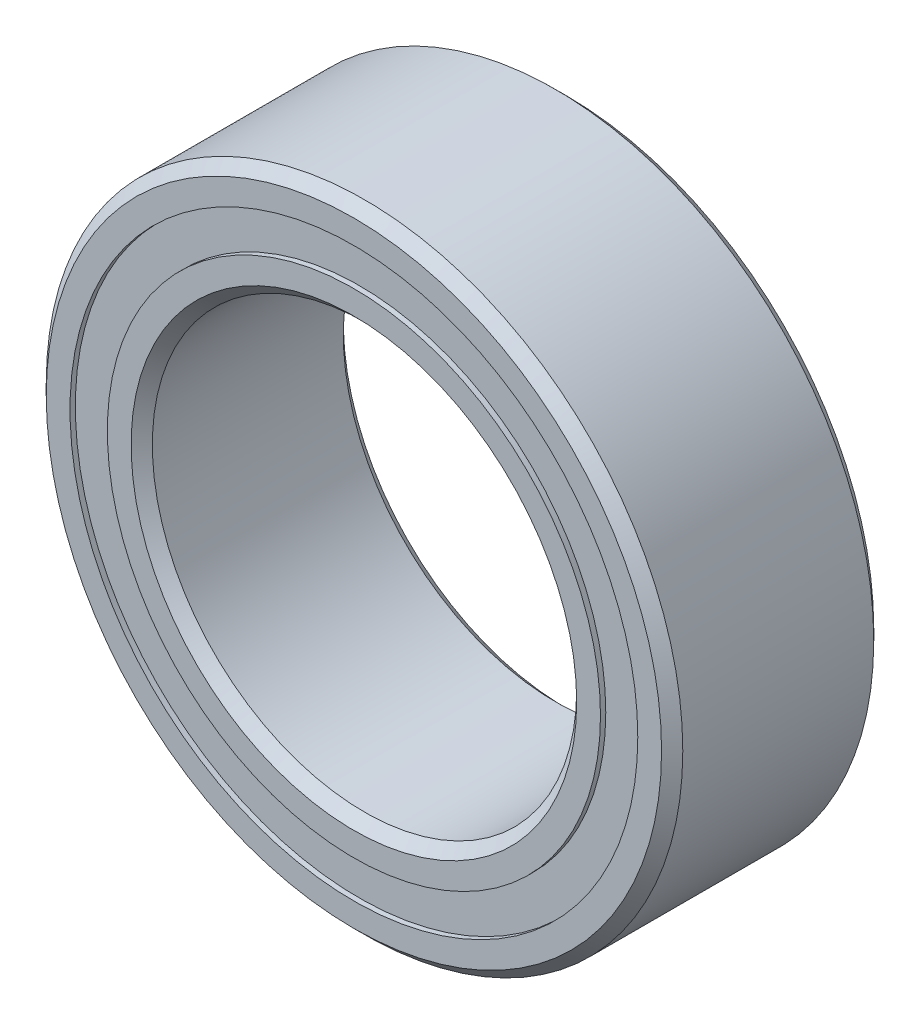
ISO-10303-21;
HEADER;
FILE_DESCRIPTION(('STEP AP214'),'2;1');
FILE_NAME('part.step','',(''),(''),'','','');
FILE_SCHEMA(('AUTOMOTIVE_DESIGN { 1 0 10303 214 1 1 1 1 }'));
ENDSEC;
DATA;
#1=APPLICATION_CONTEXT('core data for automotive mechanical design processes');
#2=APPLICATION_PROTOCOL_DEFINITION('international standard','automotive_design',2000,#1);
#3=PRODUCT_CONTEXT('',#1,'mechanical');
#4=PRODUCT('Part','Part','',(#3));
#5=PRODUCT_RELATED_PRODUCT_CATEGORY('part','',(#4));
#6=PRODUCT_DEFINITION_FORMATION('','',#4);
#7=PRODUCT_DEFINITION_CONTEXT('part definition',#1,'design');
#8=PRODUCT_DEFINITION('design','',#6,#7);
#9=PRODUCT_DEFINITION_SHAPE('','',#8);
#10=(LENGTH_UNIT() NAMED_UNIT(*) SI_UNIT(.MILLI.,.METRE.));
#11=(NAMED_UNIT(*) PLANE_ANGLE_UNIT() SI_UNIT($,.RADIAN.));
#12=(NAMED_UNIT(*) SI_UNIT($,.STERADIAN.) SOLID_ANGLE_UNIT());
#13=UNCERTAINTY_MEASURE_WITH_UNIT(LENGTH_MEASURE(1.E-05),#10,'distance_accuracy_value','');
#14=(GEOMETRIC_REPRESENTATION_CONTEXT(3) GLOBAL_UNCERTAINTY_ASSIGNED_CONTEXT((#13)) GLOBAL_UNIT_ASSIGNED_CONTEXT((#10,
#11,#12)) REPRESENTATION_CONTEXT('',''));
#15=CARTESIAN_POINT('',(0.,0.,0.));
#16=DIRECTION('',(0.,0.,1.));
#17=DIRECTION('',(1.,0.,0.));
#18=AXIS2_PLACEMENT_3D('',#15,#16,#17);
#19=CARTESIAN_POINT('',(-1.98437500000003,-3.43703832126947,0.));
#20=DIRECTION('',(-0.500000000000007,-0.866025403784435,0.));
#21=DIRECTION('',(0.,0.,-1.));
#22=AXIS2_PLACEMENT_3D('',#19,#20,#21);
#23=SPHERICAL_SURFACE('',#22,0.758760243513404);
#24=CARTESIAN_POINT('',(-2.36375512175674,-4.09414396753375,0.));
#25=VERTEX_POINT('',#24);
#26=VERTEX_LOOP('',#25);
#27=FACE_BOUND('',#26,.T.);
#28=CARTESIAN_POINT('',(-1.60499487824332,-2.7799326750052,0.));
#29=VERTEX_POINT('',#28);
#30=VERTEX_LOOP('',#29);
#31=FACE_BOUND('',#30,.T.);
#32=ADVANCED_FACE('P0_F16',(#27,#31),#23,.T.);
#33=CLOSED_SHELL('',(#32));
#34=MANIFOLD_SOLID_BREP('P0_B1',#33);
#35=CARTESIAN_POINT('',(0.,3.96875,0.));
#36=DIRECTION('',(0.,1.,0.));
#37=DIRECTION('',(0.,0.,-1.));
#38=AXIS2_PLACEMENT_3D('',#35,#36,#37);
#39=SPHERICAL_SURFACE('',#38,0.758760243513404);
#40=CARTESIAN_POINT('',(0.,3.2099897564866,0.));
#41=VERTEX_POINT('',#40);
#42=VERTEX_LOOP('',#41);
#43=FACE_BOUND('',#42,.T.);
#44=CARTESIAN_POINT('',(0.,4.7275102435134,0.));
#45=VERTEX_POINT('',#44);
#46=VERTEX_LOOP('',#45);
#47=FACE_BOUND('',#46,.T.);
#48=ADVANCED_FACE('P1_F16',(#43,#47),#39,.T.);
#49=CLOSED_SHELL('',(#48));
#50=MANIFOLD_SOLID_BREP('P1_B1',#49);
#51=CARTESIAN_POINT('',(3.43703832126948,-1.98437500000002,0.));
#52=DIRECTION('',(0.866025403784437,-0.500000000000004,0.));
#53=DIRECTION('',(0.,0.,-1.));
#54=AXIS2_PLACEMENT_3D('',#51,#52,#53);
#55=SPHERICAL_SURFACE('',#54,0.758760243513404);
#56=CARTESIAN_POINT('',(4.09414396753376,-2.36375512175672,0.));
#57=VERTEX_POINT('',#56);
#58=VERTEX_LOOP('',#57);
#59=FACE_BOUND('',#58,.T.);
#60=CARTESIAN_POINT('',(2.77993267500521,-1.60499487824331,0.));
#61=VERTEX_POINT('',#60);
#62=VERTEX_LOOP('',#61);
#63=FACE_BOUND('',#62,.T.);
#64=ADVANCED_FACE('P2_F16',(#59,#63),#55,.T.);
#65=CLOSED_SHELL('',(#64));
#66=MANIFOLD_SOLID_BREP('P2_B1',#65);
#67=CARTESIAN_POINT('',(3.96875,0.,0.));
#68=DIRECTION('',(1.,0.,0.));
#69=DIRECTION('',(0.,0.,-1.));
#70=AXIS2_PLACEMENT_3D('',#67,#68,#69);
#71=SPHERICAL_SURFACE('',#70,0.758760243513404);
#72=CARTESIAN_POINT('',(3.2099897564866,0.,0.));
#73=VERTEX_POINT('',#72);
#74=VERTEX_LOOP('',#73);
#75=FACE_BOUND('',#74,.T.);
#76=CARTESIAN_POINT('',(4.7275102435134,0.,0.));
#77=VERTEX_POINT('',#76);
#78=VERTEX_LOOP('',#77);
#79=FACE_BOUND('',#78,.T.);
#80=ADVANCED_FACE('P3_F16',(#75,#79),#71,.T.);
#81=CLOSED_SHELL('',(#80));
#82=MANIFOLD_SOLID_BREP('P3_B1',#81);
#83=CARTESIAN_POINT('',(0.,0.,0.));
#84=DIRECTION('',(0.,0.,1.));
#85=DIRECTION('',(1.,0.,0.));
#86=AXIS2_PLACEMENT_3D('',#83,#84,#85);
#87=TOROIDAL_SURFACE('',#86,3.96875,0.758760243513404);
#88=CARTESIAN_POINT('',(0.,0.,-0.705555555555556));
#89=DIRECTION('',(0.,0.,1.));
#90=DIRECTION('',(1.,0.,0.));
#91=AXIS2_PLACEMENT_3D('',#88,#89,#90);
#92=CIRCLE('',#91,4.24787087912088);
#93=CARTESIAN_POINT('',(4.24787087912088,0.,-0.705555555555556));
#94=VERTEX_POINT('',#93);
#95=EDGE_CURVE('P4_E33',#94,#94,#92,.F.);
#96=ORIENTED_EDGE('',*,*,#95,.T.);
#97=EDGE_LOOP('',(#96));
#98=FACE_BOUND('',#97,.T.);
#99=CARTESIAN_POINT('',(0.,0.,0.705555555555555));
#100=DIRECTION('',(0.,0.,1.));
#101=DIRECTION('',(1.,0.,0.));
#102=AXIS2_PLACEMENT_3D('',#99,#100,#101);
#103=CIRCLE('',#102,4.24787087912088);
#104=CARTESIAN_POINT('',(4.24787087912088,0.,0.705555555555555));
#105=VERTEX_POINT('',#104);
#106=EDGE_CURVE('P4_E31',#105,#105,#103,.T.);
#107=ORIENTED_EDGE('',*,*,#106,.T.);
#108=EDGE_LOOP('',(#107));
#109=FACE_BOUND('',#108,.T.);
#110=ADVANCED_FACE('P4_F15',(#98,#109),#87,.F.);
#111=CARTESIAN_POINT('',(0.,0.,1.5875));
#112=DIRECTION('',(0.,0.,1.));
#113=DIRECTION('',(1.,0.,0.));
#114=AXIS2_PLACEMENT_3D('',#111,#112,#113);
#115=CYLINDRICAL_SURFACE('',#114,4.24787087912088);
#116=CARTESIAN_POINT('',(0.,0.,-1.5875));
#117=DIRECTION('',(0.,0.,1.));
#118=DIRECTION('',(1.,0.,0.));
#119=AXIS2_PLACEMENT_3D('',#116,#117,#118);
#120=CIRCLE('',#119,4.24787087912088);
#121=CARTESIAN_POINT('',(4.24787087912088,0.,-1.5875));
#122=VERTEX_POINT('',#121);
#123=EDGE_CURVE('P4_E19',#122,#122,#120,.F.);
#124=ORIENTED_EDGE('',*,*,#123,.T.);
#125=EDGE_LOOP('',(#124));
#126=FACE_BOUND('',#125,.T.);
#127=ORIENTED_EDGE('',*,*,#95,.F.);
#128=EDGE_LOOP('',(#127));
#129=FACE_BOUND('',#128,.T.);
#130=ADVANCED_FACE('P4_F49',(#126,#129),#115,.F.);
#131=CARTESIAN_POINT('',(0.,0.,1.5875));
#132=DIRECTION('',(0.,0.,1.));
#133=DIRECTION('',(1.,0.,0.));
#134=AXIS2_PLACEMENT_3D('',#131,#132,#133);
#135=CYLINDRICAL_SURFACE('',#134,4.24787087912088);
#136=ORIENTED_EDGE('',*,*,#106,.F.);
#137=EDGE_LOOP('',(#136));
#138=FACE_BOUND('',#137,.T.);
#139=CARTESIAN_POINT('',(0.,0.,1.5875));
#140=DIRECTION('',(0.,0.,1.));
#141=DIRECTION('',(1.,0.,0.));
#142=AXIS2_PLACEMENT_3D('',#139,#140,#141);
#143=CIRCLE('',#142,4.24787087912088);
#144=CARTESIAN_POINT('',(4.24787087912088,0.,1.5875));
#145=VERTEX_POINT('',#144);
#146=EDGE_CURVE('P4_E42',#145,#145,#143,.T.);
#147=ORIENTED_EDGE('',*,*,#146,.T.);
#148=EDGE_LOOP('',(#147));
#149=FACE_BOUND('',#148,.T.);
#150=ADVANCED_FACE('P4_F56',(#138,#149),#135,.F.);
#151=CARTESIAN_POINT('',(0.,4.60375,-1.5875));
#152=DIRECTION('',(0.,0.,1.));
#153=DIRECTION('',(1.,0.,0.));
#154=AXIS2_PLACEMENT_3D('',#151,#152,#153);
#155=PLANE('',#154);
#156=ORIENTED_EDGE('',*,*,#123,.F.);
#157=EDGE_LOOP('',(#156));
#158=FACE_BOUND('',#157,.T.);
#159=CARTESIAN_POINT('',(0.,0.,-1.58750000008467));
#160=DIRECTION('',(0.,0.,1.));
#161=DIRECTION('',(1.,0.,0.));
#162=AXIS2_PLACEMENT_3D('',#159,#160,#161);
#163=CIRCLE('',#162,4.60375000000113);
#164=CARTESIAN_POINT('',(4.60375000000113,0.,-1.58750000008467));
#165=VERTEX_POINT('',#164);
#166=EDGE_CURVE('P4_E40',#165,#165,#163,.T.);
#167=ORIENTED_EDGE('',*,*,#166,.F.);
#168=EDGE_LOOP('',(#167));
#169=FACE_BOUND('',#168,.T.);
#170=ADVANCED_FACE('P4_F52',(#158,#169),#155,.F.);
#171=CARTESIAN_POINT('',(0.,4.60375,1.5875));
#172=DIRECTION('',(0.,0.,-1.));
#173=DIRECTION('',(-1.,0.,0.));
#174=AXIS2_PLACEMENT_3D('',#171,#172,#173);
#175=PLANE('',#174);
#176=CARTESIAN_POINT('',(0.,0.,1.58750000008467));
#177=DIRECTION('',(0.,0.,-1.));
#178=DIRECTION('',(-1.,0.,0.));
#179=AXIS2_PLACEMENT_3D('',#176,#177,#178);
#180=CIRCLE('',#179,4.60375000000113);
#181=CARTESIAN_POINT('',(-4.60375000000113,0.,1.58750000008467));
#182=VERTEX_POINT('',#181);
#183=EDGE_CURVE('P4_E28',#182,#182,#180,.T.);
#184=ORIENTED_EDGE('',*,*,#183,.F.);
#185=EDGE_LOOP('',(#184));
#186=FACE_BOUND('',#185,.T.);
#187=ORIENTED_EDGE('',*,*,#146,.F.);
#188=EDGE_LOOP('',(#187));
#189=FACE_BOUND('',#188,.T.);
#190=ADVANCED_FACE('P4_F55',(#186,#189),#175,.F.);
#191=CARTESIAN_POINT('',(0.,0.,-1.42875000000231));
#192=DIRECTION('',(0.,0.,1.));
#193=DIRECTION('',(1.,0.,0.));
#194=AXIS2_PLACEMENT_3D('',#191,#192,#193);
#195=CONICAL_SURFACE('',#194,4.76250000002665,0.785398163218414);
#196=CARTESIAN_POINT('',(0.,0.,-1.42875));
#197=DIRECTION('',(0.,0.,1.));
#198=DIRECTION('',(1.,0.,0.));
#199=AXIS2_PLACEMENT_3D('',#196,#197,#198);
#200=CIRCLE('',#199,4.7625);
#201=CARTESIAN_POINT('',(4.7625,0.,-1.42875));
#202=VERTEX_POINT('',#201);
#203=EDGE_CURVE('P4_E23',#202,#202,#200,.T.);
#204=ORIENTED_EDGE('',*,*,#203,.F.);
#205=EDGE_LOOP('',(#204));
#206=FACE_BOUND('',#205,.T.);
#207=ORIENTED_EDGE('',*,*,#166,.T.);
#208=EDGE_LOOP('',(#207));
#209=FACE_BOUND('',#208,.T.);
#210=ADVANCED_FACE('P4_F60',(#206,#209),#195,.T.);
#211=CARTESIAN_POINT('',(0.,0.,1.42875000005915));
#212=DIRECTION('',(0.,0.,-1.));
#213=DIRECTION('',(-1.,0.,0.));
#214=AXIS2_PLACEMENT_3D('',#211,#212,#213);
#215=CONICAL_SURFACE('',#214,4.7624999999698,0.785398163218414);
#216=CARTESIAN_POINT('',(0.,0.,1.42875));
#217=DIRECTION('',(0.,0.,1.));
#218=DIRECTION('',(1.,0.,0.));
#219=AXIS2_PLACEMENT_3D('',#216,#217,#218);
#220=CIRCLE('',#219,4.7625);
#221=CARTESIAN_POINT('',(4.7625,0.,1.42875));
#222=VERTEX_POINT('',#221);
#223=EDGE_CURVE('P4_E10',#222,#222,#220,.F.);
#224=ORIENTED_EDGE('',*,*,#223,.F.);
#225=EDGE_LOOP('',(#224));
#226=FACE_BOUND('',#225,.T.);
#227=ORIENTED_EDGE('',*,*,#183,.T.);
#228=EDGE_LOOP('',(#227));
#229=FACE_BOUND('',#228,.T.);
#230=ADVANCED_FACE('P4_F62',(#226,#229),#215,.T.);
#231=CARTESIAN_POINT('',(0.,0.,1.5875));
#232=DIRECTION('',(0.,0.,1.));
#233=DIRECTION('',(1.,0.,0.));
#234=AXIS2_PLACEMENT_3D('',#231,#232,#233);
#235=CYLINDRICAL_SURFACE('',#234,4.7625);
#236=ORIENTED_EDGE('',*,*,#223,.T.);
#237=EDGE_LOOP('',(#236));
#238=FACE_BOUND('',#237,.T.);
#239=ORIENTED_EDGE('',*,*,#203,.T.);
#240=EDGE_LOOP('',(#239));
#241=FACE_BOUND('',#240,.T.);
#242=ADVANCED_FACE('P4_F70',(#238,#241),#235,.T.);
#243=CLOSED_SHELL('',(#110,#130,#150,#170,#190,#210,#230,#242));
#244=MANIFOLD_SOLID_BREP('P4_B1',#243);
#245=CARTESIAN_POINT('',(1.984375,3.43703832126949,0.));
#246=DIRECTION('',(0.500000000000001,0.866025403784438,0.));
#247=DIRECTION('',(0.,0.,-1.));
#248=AXIS2_PLACEMENT_3D('',#245,#246,#247);
#249=SPHERICAL_SURFACE('',#248,0.758760243513404);
#250=CARTESIAN_POINT('',(2.36375512175671,4.09414396753376,0.));
#251=VERTEX_POINT('',#250);
#252=VERTEX_LOOP('',#251);
#253=FACE_BOUND('',#252,.T.);
#254=CARTESIAN_POINT('',(1.6049948782433,2.77993267500521,0.));
#255=VERTEX_POINT('',#254);
#256=VERTEX_LOOP('',#255);
#257=FACE_BOUND('',#256,.T.);
#258=ADVANCED_FACE('P5_F16',(#253,#257),#249,.T.);
#259=CLOSED_SHELL('',(#258));
#260=MANIFOLD_SOLID_BREP('P5_B1',#259);
#261=CARTESIAN_POINT('',(1.98437499999998,-3.4370383212695,0.));
#262=DIRECTION('',(0.499999999999995,-0.866025403784442,0.));
#263=DIRECTION('',(0.,0.,-1.));
#264=AXIS2_PLACEMENT_3D('',#261,#262,#263);
#265=SPHERICAL_SURFACE('',#264,0.758760243513404);
#266=CARTESIAN_POINT('',(1.60499487824328,-2.77993267500523,0.));
#267=VERTEX_POINT('',#266);
#268=VERTEX_LOOP('',#267);
#269=FACE_BOUND('',#268,.T.);
#270=CARTESIAN_POINT('',(2.36375512175668,-4.09414396753378,0.));
#271=VERTEX_POINT('',#270);
#272=VERTEX_LOOP('',#271);
#273=FACE_BOUND('',#272,.T.);
#274=ADVANCED_FACE('P6_F16',(#269,#273),#265,.T.);
#275=CLOSED_SHELL('',(#274));
#276=MANIFOLD_SOLID_BREP('P6_B1',#275);
#277=CARTESIAN_POINT('',(-3.96875,0.,0.));
#278=DIRECTION('',(-1.,0.,0.));
#279=DIRECTION('',(0.,0.,-1.));
#280=AXIS2_PLACEMENT_3D('',#277,#278,#279);
#281=SPHERICAL_SURFACE('',#280,0.758760243513404);
#282=CARTESIAN_POINT('',(-4.7275102435134,0.,0.));
#283=VERTEX_POINT('',#282);
#284=VERTEX_LOOP('',#283);
#285=FACE_BOUND('',#284,.T.);
#286=CARTESIAN_POINT('',(-3.2099897564866,0.,0.));
#287=VERTEX_POINT('',#286);
#288=VERTEX_LOOP('',#287);
#289=FACE_BOUND('',#288,.T.);
#290=ADVANCED_FACE('P7_F16',(#285,#289),#281,.T.);
#291=CLOSED_SHELL('',(#290));
#292=MANIFOLD_SOLID_BREP('P7_B1',#291);
#293=CARTESIAN_POINT('',(-1.98437499999996,3.43703832126952,0.));
#294=DIRECTION('',(-0.499999999999989,0.866025403784445,0.));
#295=DIRECTION('',(0.,0.,-1.));
#296=AXIS2_PLACEMENT_3D('',#293,#294,#295);
#297=SPHERICAL_SURFACE('',#296,0.758760243513404);
#298=CARTESIAN_POINT('',(-2.36375512175665,4.0941439675338,0.));
#299=VERTEX_POINT('',#298);
#300=VERTEX_LOOP('',#299);
#301=FACE_BOUND('',#300,.T.);
#302=CARTESIAN_POINT('',(-1.60499487824326,2.77993267500524,0.));
#303=VERTEX_POINT('',#302);
#304=VERTEX_LOOP('',#303);
#305=FACE_BOUND('',#304,.T.);
#306=ADVANCED_FACE('P8_F16',(#301,#305),#297,.T.);
#307=CLOSED_SHELL('',(#306));
#308=MANIFOLD_SOLID_BREP('P8_B1',#307);
#309=CARTESIAN_POINT('',(0.,-3.96875,0.));
#310=DIRECTION('',(0.,-1.,0.));
#311=DIRECTION('',(0.,0.,-1.));
#312=AXIS2_PLACEMENT_3D('',#309,#310,#311);
#313=SPHERICAL_SURFACE('',#312,0.758760243513404);
#314=CARTESIAN_POINT('',(0.,-3.2099897564866,0.));
#315=VERTEX_POINT('',#314);
#316=VERTEX_LOOP('',#315);
#317=FACE_BOUND('',#316,.T.);
#318=CARTESIAN_POINT('',(0.,-4.7275102435134,0.));
#319=VERTEX_POINT('',#318);
#320=VERTEX_LOOP('',#319);
#321=FACE_BOUND('',#320,.T.);
#322=ADVANCED_FACE('P9_F16',(#317,#321),#313,.T.);
#323=CLOSED_SHELL('',(#322));
#324=MANIFOLD_SOLID_BREP('P9_B1',#323);
#325=CARTESIAN_POINT('',(0.,4.24787087912088,0.758760243513404));
#326=DIRECTION('',(0.,0.,1.));
#327=DIRECTION('',(1.,0.,0.));
#328=AXIS2_PLACEMENT_3D('',#325,#326,#327);
#329=PLANE('',#328);
#330=CARTESIAN_POINT('',(0.,0.,0.758760243513404));
#331=DIRECTION('',(0.,0.,1.));
#332=DIRECTION('',(1.,0.,0.));
#333=AXIS2_PLACEMENT_3D('',#330,#331,#332);
#334=CIRCLE('',#333,3.68962912087912);
#335=CARTESIAN_POINT('',(3.68962912087912,0.,0.758760243513404));
#336=VERTEX_POINT('',#335);
#337=EDGE_CURVE('P10_E18',#336,#336,#334,.T.);
#338=ORIENTED_EDGE('',*,*,#337,.T.);
#339=EDGE_LOOP('',(#338));
#340=FACE_BOUND('',#339,.T.);
#341=CARTESIAN_POINT('',(0.,0.,0.758760243513404));
#342=DIRECTION('',(0.,0.,1.));
#343=DIRECTION('',(1.,0.,0.));
#344=AXIS2_PLACEMENT_3D('',#341,#342,#343);
#345=CIRCLE('',#344,4.24787087912088);
#346=CARTESIAN_POINT('',(4.24787087912088,0.,0.758760243513404));
#347=VERTEX_POINT('',#346);
#348=EDGE_CURVE('P10_E27',#347,#347,#345,.T.);
#349=ORIENTED_EDGE('',*,*,#348,.F.);
#350=EDGE_LOOP('',(#349));
#351=FACE_BOUND('',#350,.T.);
#352=ADVANCED_FACE('P10_F15',(#340,#351),#329,.F.);
#353=CARTESIAN_POINT('',(0.,0.,1.5875));
#354=DIRECTION('',(0.,0.,1.));
#355=DIRECTION('',(1.,0.,0.));
#356=AXIS2_PLACEMENT_3D('',#353,#354,#355);
#357=CYLINDRICAL_SURFACE('',#356,3.68962912087912);
#358=ORIENTED_EDGE('',*,*,#337,.F.);
#359=EDGE_LOOP('',(#358));
#360=FACE_BOUND('',#359,.T.);
#361=CARTESIAN_POINT('',(0.,0.,1.508125));
#362=DIRECTION('',(0.,0.,1.));
#363=DIRECTION('',(1.,0.,0.));
#364=AXIS2_PLACEMENT_3D('',#361,#362,#363);
#365=CIRCLE('',#364,3.68962912087912);
#366=CARTESIAN_POINT('',(3.68962912087912,0.,1.508125));
#367=VERTEX_POINT('',#366);
#368=EDGE_CURVE('P10_E22',#367,#367,#365,.T.);
#369=ORIENTED_EDGE('',*,*,#368,.T.);
#370=EDGE_LOOP('',(#369));
#371=FACE_BOUND('',#370,.T.);
#372=ADVANCED_FACE('P10_F37',(#360,#371),#357,.F.);
#373=CARTESIAN_POINT('',(0.,0.,1.5875));
#374=DIRECTION('',(0.,0.,1.));
#375=DIRECTION('',(1.,0.,0.));
#376=AXIS2_PLACEMENT_3D('',#373,#374,#375);
#377=CYLINDRICAL_SURFACE('',#376,4.24787087912088);
#378=CARTESIAN_POINT('',(0.,0.,1.508125));
#379=DIRECTION('',(0.,0.,1.));
#380=DIRECTION('',(1.,0.,0.));
#381=AXIS2_PLACEMENT_3D('',#378,#379,#380);
#382=CIRCLE('',#381,4.24787087912088);
#383=CARTESIAN_POINT('',(4.24787087912088,0.,1.508125));
#384=VERTEX_POINT('',#383);
#385=EDGE_CURVE('P10_E10',#384,#384,#382,.F.);
#386=ORIENTED_EDGE('',*,*,#385,.T.);
#387=EDGE_LOOP('',(#386));
#388=FACE_BOUND('',#387,.T.);
#389=ORIENTED_EDGE('',*,*,#348,.T.);
#390=EDGE_LOOP('',(#389));
#391=FACE_BOUND('',#390,.T.);
#392=ADVANCED_FACE('P10_F40',(#388,#391),#377,.T.);
#393=CARTESIAN_POINT('',(0.,4.24787087912088,1.508125));
#394=DIRECTION('',(0.,0.,-1.));
#395=DIRECTION('',(-1.,0.,0.));
#396=AXIS2_PLACEMENT_3D('',#393,#394,#395);
#397=PLANE('',#396);
#398=ORIENTED_EDGE('',*,*,#385,.F.);
#399=EDGE_LOOP('',(#398));
#400=FACE_BOUND('',#399,.T.);
#401=ORIENTED_EDGE('',*,*,#368,.F.);
#402=EDGE_LOOP('',(#401));
#403=FACE_BOUND('',#402,.T.);
#404=ADVANCED_FACE('P10_F43',(#400,#403),#397,.F.);
#405=CLOSED_SHELL('',(#352,#372,#392,#404));
#406=MANIFOLD_SOLID_BREP('P10_B1',#405);
#407=CARTESIAN_POINT('',(3.4370383212695,1.98437499999999,0.));
#408=DIRECTION('',(0.86602540378444,0.499999999999998,0.));
#409=DIRECTION('',(0.,0.,-1.));
#410=AXIS2_PLACEMENT_3D('',#407,#408,#409);
#411=SPHERICAL_SURFACE('',#410,0.758760243513404);
#412=CARTESIAN_POINT('',(4.09414396753377,2.36375512175669,0.));
#413=VERTEX_POINT('',#412);
#414=VERTEX_LOOP('',#413);
#415=FACE_BOUND('',#414,.T.);
#416=CARTESIAN_POINT('',(2.77993267500522,1.60499487824329,0.));
#417=VERTEX_POINT('',#416);
#418=VERTEX_LOOP('',#417);
#419=FACE_BOUND('',#418,.T.);
#420=ADVANCED_FACE('P11_F16',(#415,#419),#411,.T.);
#421=CLOSED_SHELL('',(#420));
#422=MANIFOLD_SOLID_BREP('P11_B1',#421);
#423=CARTESIAN_POINT('',(0.,4.24787087912088,-1.508125));
#424=DIRECTION('',(0.,0.,1.));
#425=DIRECTION('',(1.,0.,0.));
#426=AXIS2_PLACEMENT_3D('',#423,#424,#425);
#427=PLANE('',#426);
#428=CARTESIAN_POINT('',(0.,0.,-1.508125));
#429=DIRECTION('',(0.,0.,1.));
#430=DIRECTION('',(1.,0.,0.));
#431=AXIS2_PLACEMENT_3D('',#428,#429,#430);
#432=CIRCLE('',#431,3.68962912087912);
#433=CARTESIAN_POINT('',(3.68962912087912,0.,-1.508125));
#434=VERTEX_POINT('',#433);
#435=EDGE_CURVE('P12_E18',#434,#434,#432,.T.);
#436=ORIENTED_EDGE('',*,*,#435,.T.);
#437=EDGE_LOOP('',(#436));
#438=FACE_BOUND('',#437,.T.);
#439=CARTESIAN_POINT('',(0.,0.,-1.508125));
#440=DIRECTION('',(0.,0.,1.));
#441=DIRECTION('',(1.,0.,0.));
#442=AXIS2_PLACEMENT_3D('',#439,#440,#441);
#443=CIRCLE('',#442,4.24787087912088);
#444=CARTESIAN_POINT('',(4.24787087912088,0.,-1.508125));
#445=VERTEX_POINT('',#444);
#446=EDGE_CURVE('P12_E27',#445,#445,#443,.T.);
#447=ORIENTED_EDGE('',*,*,#446,.F.);
#448=EDGE_LOOP('',(#447));
#449=FACE_BOUND('',#448,.T.);
#450=ADVANCED_FACE('P12_F15',(#438,#449),#427,.F.);
#451=CARTESIAN_POINT('',(0.,0.,1.5875));
#452=DIRECTION('',(0.,0.,1.));
#453=DIRECTION('',(1.,0.,0.));
#454=AXIS2_PLACEMENT_3D('',#451,#452,#453);
#455=CYLINDRICAL_SURFACE('',#454,3.68962912087912);
#456=ORIENTED_EDGE('',*,*,#435,.F.);
#457=EDGE_LOOP('',(#456));
#458=FACE_BOUND('',#457,.T.);
#459=CARTESIAN_POINT('',(0.,0.,-0.758760243513405));
#460=DIRECTION('',(0.,0.,1.));
#461=DIRECTION('',(1.,0.,0.));
#462=AXIS2_PLACEMENT_3D('',#459,#460,#461);
#463=CIRCLE('',#462,3.68962912087912);
#464=CARTESIAN_POINT('',(3.68962912087912,0.,-0.758760243513405));
#465=VERTEX_POINT('',#464);
#466=EDGE_CURVE('P12_E22',#465,#465,#463,.T.);
#467=ORIENTED_EDGE('',*,*,#466,.T.);
#468=EDGE_LOOP('',(#467));
#469=FACE_BOUND('',#468,.T.);
#470=ADVANCED_FACE('P12_F37',(#458,#469),#455,.F.);
#471=CARTESIAN_POINT('',(0.,0.,1.5875));
#472=DIRECTION('',(0.,0.,1.));
#473=DIRECTION('',(1.,0.,0.));
#474=AXIS2_PLACEMENT_3D('',#471,#472,#473);
#475=CYLINDRICAL_SURFACE('',#474,4.24787087912088);
#476=CARTESIAN_POINT('',(0.,0.,-0.758760243513404));
#477=DIRECTION('',(0.,0.,1.));
#478=DIRECTION('',(1.,0.,0.));
#479=AXIS2_PLACEMENT_3D('',#476,#477,#478);
#480=CIRCLE('',#479,4.24787087912088);
#481=CARTESIAN_POINT('',(4.24787087912088,0.,-0.758760243513404));
#482=VERTEX_POINT('',#481);
#483=EDGE_CURVE('P12_E10',#482,#482,#480,.F.);
#484=ORIENTED_EDGE('',*,*,#483,.T.);
#485=EDGE_LOOP('',(#484));
#486=FACE_BOUND('',#485,.T.);
#487=ORIENTED_EDGE('',*,*,#446,.T.);
#488=EDGE_LOOP('',(#487));
#489=FACE_BOUND('',#488,.T.);
#490=ADVANCED_FACE('P12_F40',(#486,#489),#475,.T.);
#491=CARTESIAN_POINT('',(0.,4.24787087912088,-0.758760243513404));
#492=DIRECTION('',(0.,0.,-1.));
#493=DIRECTION('',(-1.,0.,0.));
#494=AXIS2_PLACEMENT_3D('',#491,#492,#493);
#495=PLANE('',#494);
#496=ORIENTED_EDGE('',*,*,#483,.F.);
#497=EDGE_LOOP('',(#496));
#498=FACE_BOUND('',#497,.T.);
#499=ORIENTED_EDGE('',*,*,#466,.F.);
#500=EDGE_LOOP('',(#499));
#501=FACE_BOUND('',#500,.T.);
#502=ADVANCED_FACE('P12_F43',(#498,#501),#495,.F.);
#503=CLOSED_SHELL('',(#450,#470,#490,#502));
#504=MANIFOLD_SOLID_BREP('P12_B1',#503);
#505=CARTESIAN_POINT('',(0.,0.,0.));
#506=DIRECTION('',(0.,0.,1.));
#507=DIRECTION('',(1.,0.,0.));
#508=AXIS2_PLACEMENT_3D('',#505,#506,#507);
#509=TOROIDAL_SURFACE('',#508,3.96875,0.758760243513403);
#510=CARTESIAN_POINT('',(0.,0.,0.705555555555556));
#511=DIRECTION('',(0.,0.,1.));
#512=DIRECTION('',(1.,0.,0.));
#513=AXIS2_PLACEMENT_3D('',#510,#511,#512);
#514=CIRCLE('',#513,3.68962912087912);
#515=CARTESIAN_POINT('',(3.68962912087912,0.,0.705555555555556));
#516=VERTEX_POINT('',#515);
#517=EDGE_CURVE('P13_E33',#516,#516,#514,.T.);
#518=ORIENTED_EDGE('',*,*,#517,.F.);
#519=EDGE_LOOP('',(#518));
#520=FACE_BOUND('',#519,.T.);
#521=CARTESIAN_POINT('',(0.,0.,-0.705555555555556));
#522=DIRECTION('',(0.,0.,1.));
#523=DIRECTION('',(1.,0.,0.));
#524=AXIS2_PLACEMENT_3D('',#521,#522,#523);
#525=CIRCLE('',#524,3.68962912087912);
#526=CARTESIAN_POINT('',(3.68962912087912,0.,-0.705555555555556));
#527=VERTEX_POINT('',#526);
#528=EDGE_CURVE('P13_E31',#527,#527,#525,.F.);
#529=ORIENTED_EDGE('',*,*,#528,.F.);
#530=EDGE_LOOP('',(#529));
#531=FACE_BOUND('',#530,.T.);
#532=ADVANCED_FACE('P13_F15',(#520,#531),#509,.F.);
#533=CARTESIAN_POINT('',(0.,0.,1.5875));
#534=DIRECTION('',(0.,0.,1.));
#535=DIRECTION('',(1.,0.,0.));
#536=AXIS2_PLACEMENT_3D('',#533,#534,#535);
#537=CYLINDRICAL_SURFACE('',#536,3.68962912087912);
#538=CARTESIAN_POINT('',(0.,0.,1.5875));
#539=DIRECTION('',(0.,0.,1.));
#540=DIRECTION('',(1.,0.,0.));
#541=AXIS2_PLACEMENT_3D('',#538,#539,#540);
#542=CIRCLE('',#541,3.68962912087912);
#543=CARTESIAN_POINT('',(3.68962912087912,0.,1.5875));
#544=VERTEX_POINT('',#543);
#545=EDGE_CURVE('P13_E19',#544,#544,#542,.F.);
#546=ORIENTED_EDGE('',*,*,#545,.T.);
#547=EDGE_LOOP('',(#546));
#548=FACE_BOUND('',#547,.T.);
#549=ORIENTED_EDGE('',*,*,#517,.T.);
#550=EDGE_LOOP('',(#549));
#551=FACE_BOUND('',#550,.T.);
#552=ADVANCED_FACE('P13_F49',(#548,#551),#537,.T.);
#553=CARTESIAN_POINT('',(0.,0.,1.5875));
#554=DIRECTION('',(0.,0.,1.));
#555=DIRECTION('',(1.,0.,0.));
#556=AXIS2_PLACEMENT_3D('',#553,#554,#555);
#557=CYLINDRICAL_SURFACE('',#556,3.68962912087912);
#558=ORIENTED_EDGE('',*,*,#528,.T.);
#559=EDGE_LOOP('',(#558));
#560=FACE_BOUND('',#559,.T.);
#561=CARTESIAN_POINT('',(0.,0.,-1.5875));
#562=DIRECTION('',(0.,0.,1.));
#563=DIRECTION('',(1.,0.,0.));
#564=AXIS2_PLACEMENT_3D('',#561,#562,#563);
#565=CIRCLE('',#564,3.68962912087912);
#566=CARTESIAN_POINT('',(3.68962912087912,0.,-1.5875));
#567=VERTEX_POINT('',#566);
#568=EDGE_CURVE('P13_E42',#567,#567,#565,.T.);
#569=ORIENTED_EDGE('',*,*,#568,.T.);
#570=EDGE_LOOP('',(#569));
#571=FACE_BOUND('',#570,.T.);
#572=ADVANCED_FACE('P13_F56',(#560,#571),#557,.T.);
#573=CARTESIAN_POINT('',(0.,3.68962912087912,1.5875));
#574=DIRECTION('',(0.,0.,-1.));
#575=DIRECTION('',(-1.,0.,0.));
#576=AXIS2_PLACEMENT_3D('',#573,#574,#575);
#577=PLANE('',#576);
#578=ORIENTED_EDGE('',*,*,#545,.F.);
#579=EDGE_LOOP('',(#578));
#580=FACE_BOUND('',#579,.T.);
#581=CARTESIAN_POINT('',(0.,0.,1.58749999997099));
#582=DIRECTION('',(0.,0.,1.));
#583=DIRECTION('',(1.,0.,0.));
#584=AXIS2_PLACEMENT_3D('',#581,#582,#583);
#585=CIRCLE('',#584,3.33374999996749);
#586=CARTESIAN_POINT('',(3.33374999996749,0.,1.58749999997099));
#587=VERTEX_POINT('',#586);
#588=EDGE_CURVE('P13_E40',#587,#587,#585,.F.);
#589=ORIENTED_EDGE('',*,*,#588,.T.);
#590=EDGE_LOOP('',(#589));
#591=FACE_BOUND('',#590,.T.);
#592=ADVANCED_FACE('P13_F52',(#580,#591),#577,.F.);
#593=CARTESIAN_POINT('',(0.,3.33375,-1.5875));
#594=DIRECTION('',(0.,0.,1.));
#595=DIRECTION('',(1.,0.,0.));
#596=AXIS2_PLACEMENT_3D('',#593,#594,#595);
#597=PLANE('',#596);
#598=CARTESIAN_POINT('',(0.,0.,-1.58749999997099));
#599=DIRECTION('',(0.,0.,-1.));
#600=DIRECTION('',(0.,1.,0.));
#601=AXIS2_PLACEMENT_3D('',#598,#599,#600);
#602=CIRCLE('',#601,3.33375000002434);
#603=CARTESIAN_POINT('',(0.,3.33375000002434,-1.58749999997099));
#604=VERTEX_POINT('',#603);
#605=EDGE_CURVE('P13_E28',#604,#604,#602,.F.);
#606=ORIENTED_EDGE('',*,*,#605,.T.);
#607=EDGE_LOOP('',(#606));
#608=FACE_BOUND('',#607,.T.);
#609=ORIENTED_EDGE('',*,*,#568,.F.);
#610=EDGE_LOOP('',(#609));
#611=FACE_BOUND('',#610,.T.);
#612=ADVANCED_FACE('P13_F55',(#608,#611),#597,.F.);
#613=CARTESIAN_POINT('',(0.,0.,1.58749999991414));
#614=DIRECTION('',(0.,0.,1.));
#615=DIRECTION('',(1.,0.,0.));
#616=AXIS2_PLACEMENT_3D('',#613,#614,#615);
#617=CONICAL_SURFACE('',#616,3.33374999991065,0.785398163397448);
#618=ORIENTED_EDGE('',*,*,#588,.F.);
#619=EDGE_LOOP('',(#618));
#620=FACE_BOUND('',#619,.T.);
#621=CARTESIAN_POINT('',(0.,0.,1.42875));
#622=DIRECTION('',(0.,0.,1.));
#623=DIRECTION('',(1.,0.,0.));
#624=AXIS2_PLACEMENT_3D('',#621,#622,#623);
#625=CIRCLE('',#624,3.175);
#626=CARTESIAN_POINT('',(3.175,0.,1.42875));
#627=VERTEX_POINT('',#626);
#628=EDGE_CURVE('P13_E23',#627,#627,#625,.F.);
#629=ORIENTED_EDGE('',*,*,#628,.T.);
#630=EDGE_LOOP('',(#629));
#631=FACE_BOUND('',#630,.T.);
#632=ADVANCED_FACE('P13_F60',(#620,#631),#617,.F.);
#633=CARTESIAN_POINT('',(0.,0.,-1.58749999997099));
#634=DIRECTION('',(0.,0.,-1.));
#635=DIRECTION('',(0.,1.,0.));
#636=AXIS2_PLACEMENT_3D('',#633,#634,#635);
#637=CONICAL_SURFACE('',#636,3.33375000002434,0.785398163397448);
#638=CARTESIAN_POINT('',(0.,0.,-1.42875));
#639=DIRECTION('',(0.,0.,1.));
#640=DIRECTION('',(1.,0.,0.));
#641=AXIS2_PLACEMENT_3D('',#638,#639,#640);
#642=CIRCLE('',#641,3.175);
#643=CARTESIAN_POINT('',(3.175,0.,-1.42875));
#644=VERTEX_POINT('',#643);
#645=EDGE_CURVE('P13_E10',#644,#644,#642,.T.);
#646=ORIENTED_EDGE('',*,*,#645,.T.);
#647=EDGE_LOOP('',(#646));
#648=FACE_BOUND('',#647,.T.);
#649=ORIENTED_EDGE('',*,*,#605,.F.);
#650=EDGE_LOOP('',(#649));
#651=FACE_BOUND('',#650,.T.);
#652=ADVANCED_FACE('P13_F63',(#648,#651),#637,.F.);
#653=CARTESIAN_POINT('',(0.,0.,1.5875));
#654=DIRECTION('',(0.,0.,1.));
#655=DIRECTION('',(1.,0.,0.));
#656=AXIS2_PLACEMENT_3D('',#653,#654,#655);
#657=CYLINDRICAL_SURFACE('',#656,3.175);
#658=ORIENTED_EDGE('',*,*,#628,.F.);
#659=EDGE_LOOP('',(#658));
#660=FACE_BOUND('',#659,.T.);
#661=ORIENTED_EDGE('',*,*,#645,.F.);
#662=EDGE_LOOP('',(#661));
#663=FACE_BOUND('',#662,.T.);
#664=ADVANCED_FACE('P13_F67',(#660,#663),#657,.F.);
#665=CLOSED_SHELL('',(#532,#552,#572,#592,#612,#632,#652,#664));
#666=MANIFOLD_SOLID_BREP('P13_B1',#665);
#667=CARTESIAN_POINT('',(-3.43703832126951,-1.98437499999997,0.));
#668=DIRECTION('',(-0.866025403784443,-0.499999999999992,0.));
#669=DIRECTION('',(0.,0.,-1.));
#670=AXIS2_PLACEMENT_3D('',#667,#668,#669);
#671=SPHERICAL_SURFACE('',#670,0.758760243513404);
#672=CARTESIAN_POINT('',(-4.09414396753379,-2.36375512175666,0.));
#673=VERTEX_POINT('',#672);
#674=VERTEX_LOOP('',#673);
#675=FACE_BOUND('',#674,.T.);
#676=CARTESIAN_POINT('',(-2.77993267500523,-1.60499487824327,0.));
#677=VERTEX_POINT('',#676);
#678=VERTEX_LOOP('',#677);
#679=FACE_BOUND('',#678,.T.);
#680=ADVANCED_FACE('P14_F16',(#675,#679),#671,.T.);
#681=CLOSED_SHELL('',(#680));
#682=MANIFOLD_SOLID_BREP('P14_B1',#681);
#683=CARTESIAN_POINT('',(-3.43703832126947,1.98437500000004,0.));
#684=DIRECTION('',(-0.866025403784433,0.50000000000001,0.));
#685=DIRECTION('',(0.,0.,-1.));
#686=AXIS2_PLACEMENT_3D('',#683,#684,#685);
#687=SPHERICAL_SURFACE('',#686,0.758760243513404);
#688=CARTESIAN_POINT('',(-4.09414396753374,2.36375512175675,0.));
#689=VERTEX_POINT('',#688);
#690=VERTEX_LOOP('',#689);
#691=FACE_BOUND('',#690,.T.);
#692=CARTESIAN_POINT('',(-2.7799326750052,1.60499487824333,0.));
#693=VERTEX_POINT('',#692);
#694=VERTEX_LOOP('',#693);
#695=FACE_BOUND('',#694,.T.);
#696=ADVANCED_FACE('P15_F16',(#691,#695),#687,.T.);
#697=CLOSED_SHELL('',(#696));
#698=MANIFOLD_SOLID_BREP('P15_B1',#697);
#699=ADVANCED_BREP_SHAPE_REPRESENTATION('',(#18,#34,#50,#66,#82,#244,#260,#276,#292,#308,#324,
#406,#422,#504,#666,#682,#698),#14);
#700=SHAPE_DEFINITION_REPRESENTATION(#9,#699);
ENDSEC;
END-ISO-10303-21;
